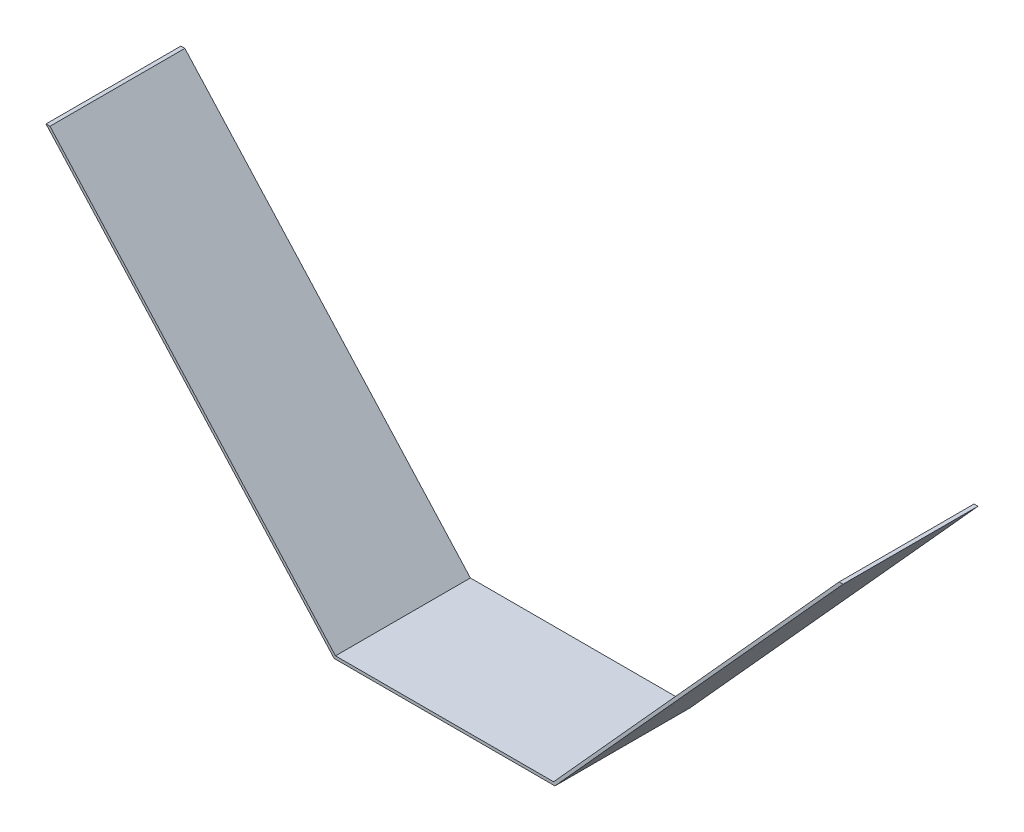
ISO-10303-21;
HEADER;
FILE_DESCRIPTION(('STEP AP214'),'2;1');
FILE_NAME('part.step','',(''),(''),'','','');
FILE_SCHEMA(('AUTOMOTIVE_DESIGN { 1 0 10303 214 1 1 1 1 }'));
ENDSEC;
DATA;
#1=APPLICATION_CONTEXT('core data for automotive mechanical design processes');
#2=APPLICATION_PROTOCOL_DEFINITION('international standard','automotive_design',2000,#1);
#3=PRODUCT_CONTEXT('',#1,'mechanical');
#4=PRODUCT('Part','Part','',(#3));
#5=PRODUCT_RELATED_PRODUCT_CATEGORY('part','',(#4));
#6=PRODUCT_DEFINITION_FORMATION('','',#4);
#7=PRODUCT_DEFINITION_CONTEXT('part definition',#1,'design');
#8=PRODUCT_DEFINITION('design','',#6,#7);
#9=PRODUCT_DEFINITION_SHAPE('','',#8);
#10=(LENGTH_UNIT() NAMED_UNIT(*) SI_UNIT(.MILLI.,.METRE.));
#11=(NAMED_UNIT(*) PLANE_ANGLE_UNIT() SI_UNIT($,.RADIAN.));
#12=(NAMED_UNIT(*) SI_UNIT($,.STERADIAN.) SOLID_ANGLE_UNIT());
#13=UNCERTAINTY_MEASURE_WITH_UNIT(LENGTH_MEASURE(1.E-05),#10,'distance_accuracy_value','');
#14=(GEOMETRIC_REPRESENTATION_CONTEXT(3) GLOBAL_UNCERTAINTY_ASSIGNED_CONTEXT((#13)) GLOBAL_UNIT_ASSIGNED_CONTEXT((#10,
#11,#12)) REPRESENTATION_CONTEXT('',''));
#15=CARTESIAN_POINT('',(0.,0.,0.));
#16=DIRECTION('',(0.,0.,1.));
#17=DIRECTION('',(1.,0.,0.));
#18=AXIS2_PLACEMENT_3D('',#15,#16,#17);
#19=CARTESIAN_POINT('',(-374.797674418605,95.5084302325581,69.85));
#20=DIRECTION('',(0.,1.,0.));
#21=DIRECTION('',(-1.,0.,0.));
#22=AXIS2_PLACEMENT_3D('',#19,#20,#21);
#23=PLANE('',#22);
#24=DIRECTION('',(1.,0.,0.));
#25=VECTOR('',#24,1.);
#26=CARTESIAN_POINT('',(-374.797674418605,95.5084302325581,69.85));
#27=LINE('',#26,#25);
#28=CARTESIAN_POINT('',(-374.797674418605,95.5084302325581,69.85));
#29=VERTEX_POINT('',#28);
#30=CARTESIAN_POINT('',(-372.743416331134,95.5084302325581,69.85));
#31=VERTEX_POINT('',#30);
#32=EDGE_CURVE('E123',#29,#31,#27,.T.);
#33=ORIENTED_EDGE('',*,*,#32,.T.);
#34=DIRECTION('',(0.,0.,-1.));
#35=VECTOR('',#34,1.);
#36=CARTESIAN_POINT('',(-372.743416331134,95.5084302325581,69.85));
#37=LINE('',#36,#35);
#38=CARTESIAN_POINT('',(-372.743416331134,95.5084302325581,0.));
#39=VERTEX_POINT('',#38);
#40=EDGE_CURVE('E112',#31,#39,#37,.T.);
#41=ORIENTED_EDGE('',*,*,#40,.T.);
#42=DIRECTION('',(1.,0.,0.));
#43=VECTOR('',#42,1.);
#44=CARTESIAN_POINT('',(-374.797674418605,95.5084302325581,0.));
#45=LINE('',#44,#43);
#46=CARTESIAN_POINT('',(-374.797674418605,95.5084302325581,0.));
#47=VERTEX_POINT('',#46);
#48=EDGE_CURVE('E121',#47,#39,#45,.T.);
#49=ORIENTED_EDGE('',*,*,#48,.F.);
#50=DIRECTION('',(0.,0.,-1.));
#51=VECTOR('',#50,1.);
#52=CARTESIAN_POINT('',(-374.797674418605,95.5084302325581,69.85));
#53=LINE('',#52,#51);
#54=EDGE_CURVE('E59',#29,#47,#53,.T.);
#55=ORIENTED_EDGE('',*,*,#54,.F.);
#56=EDGE_LOOP('',(#33,#41,#49,#55));
#57=FACE_BOUND('',#56,.T.);
#58=ADVANCED_FACE('F35',(#57),#23,.T.);
#59=CARTESIAN_POINT('',(-374.797674418605,95.5084302325581,69.85));
#60=DIRECTION('',(0.741873676581724,0.670539669218097,0.));
#61=DIRECTION('',(-0.670539669218097,0.741873676581724,0.));
#62=AXIS2_PLACEMENT_3D('',#59,#60,#61);
#63=PLANE('',#62);
#64=DIRECTION('',(0.670539669218097,-0.741873676581724,0.));
#65=VECTOR('',#64,1.);
#66=CARTESIAN_POINT('',(-374.797674418605,95.5084302325581,0.));
#67=LINE('',#66,#65);
#68=CARTESIAN_POINT('',(-225.572674418605,-69.5915697674419,0.));
#69=VERTEX_POINT('',#68);
#70=EDGE_CURVE('E128',#47,#69,#67,.T.);
#71=ORIENTED_EDGE('',*,*,#70,.T.);
#72=DIRECTION('',(0.,0.,-1.));
#73=VECTOR('',#72,1.);
#74=CARTESIAN_POINT('',(-225.572674418605,-69.5915697674419,69.85));
#75=LINE('',#74,#73);
#76=CARTESIAN_POINT('',(-225.572674418605,-69.5915697674419,69.85));
#77=VERTEX_POINT('',#76);
#78=EDGE_CURVE('E11',#77,#69,#75,.T.);
#79=ORIENTED_EDGE('',*,*,#78,.F.);
#80=DIRECTION('',(0.670539669218097,-0.741873676581724,0.));
#81=VECTOR('',#80,1.);
#82=CARTESIAN_POINT('',(-374.797674418605,95.5084302325581,69.85));
#83=LINE('',#82,#81);
#84=EDGE_CURVE('E129',#29,#77,#83,.T.);
#85=ORIENTED_EDGE('',*,*,#84,.F.);
#86=ORIENTED_EDGE('',*,*,#54,.T.);
#87=EDGE_LOOP('',(#71,#79,#85,#86));
#88=FACE_BOUND('',#87,.T.);
#89=ADVANCED_FACE('F37',(#88),#63,.F.);
#90=CARTESIAN_POINT('',(-225.572674418605,-69.5915697674419,69.85));
#91=DIRECTION('',(0.,1.,0.));
#92=DIRECTION('',(0.,0.,1.));
#93=AXIS2_PLACEMENT_3D('',#90,#91,#92);
#94=PLANE('',#93);
#95=DIRECTION('',(1.,0.,0.));
#96=VECTOR('',#95,1.);
#97=CARTESIAN_POINT('',(-225.572674418605,-69.5915697674419,0.));
#98=LINE('',#97,#96);
#99=CARTESIAN_POINT('',(-111.272674418605,-69.5915697674419,0.));
#100=VERTEX_POINT('',#99);
#101=EDGE_CURVE('E149',#69,#100,#98,.T.);
#102=ORIENTED_EDGE('',*,*,#101,.T.);
#103=DIRECTION('',(0.,0.,-1.));
#104=VECTOR('',#103,1.);
#105=CARTESIAN_POINT('',(-111.272674418605,-69.5915697674419,69.85));
#106=LINE('',#105,#104);
#107=CARTESIAN_POINT('',(-111.272674418605,-69.5915697674419,69.85));
#108=VERTEX_POINT('',#107);
#109=EDGE_CURVE('E43',#108,#100,#106,.T.);
#110=ORIENTED_EDGE('',*,*,#109,.F.);
#111=DIRECTION('',(1.,0.,0.));
#112=VECTOR('',#111,1.);
#113=CARTESIAN_POINT('',(-225.572674418605,-69.5915697674419,69.85));
#114=LINE('',#113,#112);
#115=EDGE_CURVE('E85',#77,#108,#114,.T.);
#116=ORIENTED_EDGE('',*,*,#115,.F.);
#117=ORIENTED_EDGE('',*,*,#78,.T.);
#118=EDGE_LOOP('',(#102,#110,#116,#117));
#119=FACE_BOUND('',#118,.T.);
#120=ADVANCED_FACE('F178',(#119),#94,.F.);
#121=CARTESIAN_POINT('',(-111.272674418605,-69.5915697674419,69.85));
#122=DIRECTION('',(-0.741873676581725,0.670539669218097,0.));
#123=DIRECTION('',(-0.670539669218097,-0.741873676581725,0.));
#124=AXIS2_PLACEMENT_3D('',#121,#122,#123);
#125=PLANE('',#124);
#126=DIRECTION('',(0.670539669218097,0.741873676581725,0.));
#127=VECTOR('',#126,1.);
#128=CARTESIAN_POINT('',(-111.272674418605,-69.5915697674419,0.));
#129=LINE('',#128,#127);
#130=CARTESIAN_POINT('',(37.9523255813953,95.5084302325582,0.));
#131=VERTEX_POINT('',#130);
#132=EDGE_CURVE('E133',#100,#131,#129,.T.);
#133=ORIENTED_EDGE('',*,*,#132,.T.);
#134=DIRECTION('',(0.,0.,-1.));
#135=VECTOR('',#134,1.);
#136=CARTESIAN_POINT('',(37.9523255813953,95.5084302325582,69.85));
#137=LINE('',#136,#135);
#138=CARTESIAN_POINT('',(37.9523255813953,95.5084302325582,69.85));
#139=VERTEX_POINT('',#138);
#140=EDGE_CURVE('E138',#139,#131,#137,.T.);
#141=ORIENTED_EDGE('',*,*,#140,.F.);
#142=DIRECTION('',(0.670539669218097,0.741873676581725,0.));
#143=VECTOR('',#142,1.);
#144=CARTESIAN_POINT('',(-111.272674418605,-69.5915697674419,69.85));
#145=LINE('',#144,#143);
#146=EDGE_CURVE('E148',#108,#139,#145,.T.);
#147=ORIENTED_EDGE('',*,*,#146,.F.);
#148=ORIENTED_EDGE('',*,*,#109,.T.);
#149=EDGE_LOOP('',(#133,#141,#147,#148));
#150=FACE_BOUND('',#149,.T.);
#151=ADVANCED_FACE('F145',(#150),#125,.F.);
#152=DIRECTION('',(0.,0.,-1.));
#153=VECTOR('',#152,1.);
#154=CARTESIAN_POINT('',(35.898067493924,95.5084302325582,69.85));
#155=LINE('',#154,#153);
#156=CARTESIAN_POINT('',(35.8980674939241,95.5084302325582,69.85));
#157=VERTEX_POINT('',#156);
#158=CARTESIAN_POINT('',(35.8980674939241,95.5084302325582,0.));
#159=VERTEX_POINT('',#158);
#160=EDGE_CURVE('E124',#157,#159,#155,.T.);
#161=ORIENTED_EDGE('',*,*,#160,.F.);
#162=EDGE_CURVE('E154',#157,#139,#27,.T.);
#163=ORIENTED_EDGE('',*,*,#162,.T.);
#164=ORIENTED_EDGE('',*,*,#140,.T.);
#165=EDGE_CURVE('E130',#159,#131,#45,.T.);
#166=ORIENTED_EDGE('',*,*,#165,.F.);
#167=EDGE_LOOP('',(#161,#163,#164,#166));
#168=FACE_BOUND('',#167,.T.);
#169=ADVANCED_FACE('F173',(#168),#23,.T.);
#170=CARTESIAN_POINT('',(0.,0.,69.85));
#171=DIRECTION('',(0.,0.,1.));
#172=DIRECTION('',(1.,0.,0.));
#173=AXIS2_PLACEMENT_3D('',#170,#171,#172);
#174=PLANE('',#173);
#175=DIRECTION('',(0.670539669218097,-0.741873676581724,0.));
#176=VECTOR('',#175,1.);
#177=CARTESIAN_POINT('',(-373.667058935494,96.5303326884465,69.85));
#178=LINE('',#177,#176);
#179=CARTESIAN_POINT('',(-224.895877869595,-68.0675697674419,69.85));
#180=VERTEX_POINT('',#179);
#181=EDGE_CURVE('E159',#31,#180,#178,.T.);
#182=ORIENTED_EDGE('',*,*,#181,.F.);
#183=ORIENTED_EDGE('',*,*,#32,.F.);
#184=ORIENTED_EDGE('',*,*,#84,.T.);
#185=ORIENTED_EDGE('',*,*,#115,.T.);
#186=ORIENTED_EDGE('',*,*,#146,.T.);
#187=ORIENTED_EDGE('',*,*,#162,.F.);
#188=DIRECTION('',(0.670539669218097,0.741873676581725,0.));
#189=VECTOR('',#188,1.);
#190=CARTESIAN_POINT('',(-112.403289901715,-68.5696673115535,69.85));
#191=LINE('',#190,#189);
#192=CARTESIAN_POINT('',(-111.949470967614,-68.0675697674419,69.85));
#193=VERTEX_POINT('',#192);
#194=EDGE_CURVE('E125',#193,#157,#191,.T.);
#195=ORIENTED_EDGE('',*,*,#194,.F.);
#196=DIRECTION('',(1.,0.,0.));
#197=VECTOR('',#196,1.);
#198=CARTESIAN_POINT('',(-225.572674418605,-68.0675697674419,69.85));
#199=LINE('',#198,#197);
#200=EDGE_CURVE('E163',#180,#193,#199,.T.);
#201=ORIENTED_EDGE('',*,*,#200,.F.);
#202=EDGE_LOOP('',(#182,#183,#184,#185,#186,#187,#195,#201));
#203=FACE_BOUND('',#202,.T.);
#204=ADVANCED_FACE('F176',(#203),#174,.T.);
#205=CARTESIAN_POINT('',(0.,0.,0.));
#206=DIRECTION('',(0.,0.,1.));
#207=DIRECTION('',(1.,0.,0.));
#208=AXIS2_PLACEMENT_3D('',#205,#206,#207);
#209=PLANE('',#208);
#210=ORIENTED_EDGE('',*,*,#48,.T.);
#211=DIRECTION('',(0.670539669218097,-0.741873676581724,0.));
#212=VECTOR('',#211,1.);
#213=CARTESIAN_POINT('',(-373.667058935494,96.5303326884465,0.));
#214=LINE('',#213,#212);
#215=CARTESIAN_POINT('',(-224.895877869595,-68.0675697674419,0.));
#216=VERTEX_POINT('',#215);
#217=EDGE_CURVE('E109',#39,#216,#214,.T.);
#218=ORIENTED_EDGE('',*,*,#217,.T.);
#219=DIRECTION('',(1.,0.,0.));
#220=VECTOR('',#219,1.);
#221=CARTESIAN_POINT('',(-225.572674418605,-68.0675697674419,0.));
#222=LINE('',#221,#220);
#223=CARTESIAN_POINT('',(-111.949470967614,-68.0675697674419,0.));
#224=VERTEX_POINT('',#223);
#225=EDGE_CURVE('E119',#216,#224,#222,.T.);
#226=ORIENTED_EDGE('',*,*,#225,.T.);
#227=DIRECTION('',(0.670539669218097,0.741873676581725,0.));
#228=VECTOR('',#227,1.);
#229=CARTESIAN_POINT('',(-112.403289901715,-68.5696673115535,0.));
#230=LINE('',#229,#228);
#231=EDGE_CURVE('E50',#224,#159,#230,.T.);
#232=ORIENTED_EDGE('',*,*,#231,.T.);
#233=ORIENTED_EDGE('',*,*,#165,.T.);
#234=ORIENTED_EDGE('',*,*,#132,.F.);
#235=ORIENTED_EDGE('',*,*,#101,.F.);
#236=ORIENTED_EDGE('',*,*,#70,.F.);
#237=EDGE_LOOP('',(#210,#218,#226,#232,#233,#234,#235,#236));
#238=FACE_BOUND('',#237,.T.);
#239=ADVANCED_FACE('F127',(#238),#209,.F.);
#240=CARTESIAN_POINT('',(-373.667058935494,96.5303326884465,69.85));
#241=DIRECTION('',(0.741873676581724,0.670539669218097,0.));
#242=DIRECTION('',(-0.670539669218097,0.741873676581724,0.));
#243=AXIS2_PLACEMENT_3D('',#240,#241,#242);
#244=PLANE('',#243);
#245=ORIENTED_EDGE('',*,*,#217,.F.);
#246=ORIENTED_EDGE('',*,*,#40,.F.);
#247=ORIENTED_EDGE('',*,*,#181,.T.);
#248=DIRECTION('',(0.,0.,-1.));
#249=VECTOR('',#248,1.);
#250=CARTESIAN_POINT('',(-224.895877869595,-68.0675697674419,69.85));
#251=LINE('',#250,#249);
#252=EDGE_CURVE('E115',#180,#216,#251,.T.);
#253=ORIENTED_EDGE('',*,*,#252,.T.);
#254=EDGE_LOOP('',(#245,#246,#247,#253));
#255=FACE_BOUND('',#254,.T.);
#256=ADVANCED_FACE('F111',(#255),#244,.T.);
#257=CARTESIAN_POINT('',(-225.572674418605,-68.0675697674419,69.85));
#258=DIRECTION('',(0.,1.,0.));
#259=DIRECTION('',(0.,0.,1.));
#260=AXIS2_PLACEMENT_3D('',#257,#258,#259);
#261=PLANE('',#260);
#262=ORIENTED_EDGE('',*,*,#225,.F.);
#263=ORIENTED_EDGE('',*,*,#252,.F.);
#264=ORIENTED_EDGE('',*,*,#200,.T.);
#265=DIRECTION('',(0.,0.,-1.));
#266=VECTOR('',#265,1.);
#267=CARTESIAN_POINT('',(-111.949470967614,-68.0675697674419,69.85));
#268=LINE('',#267,#266);
#269=EDGE_CURVE('E161',#193,#224,#268,.T.);
#270=ORIENTED_EDGE('',*,*,#269,.T.);
#271=EDGE_LOOP('',(#262,#263,#264,#270));
#272=FACE_BOUND('',#271,.T.);
#273=ADVANCED_FACE('F168',(#272),#261,.T.);
#274=CARTESIAN_POINT('',(-112.403289901715,-68.5696673115535,69.85));
#275=DIRECTION('',(-0.741873676581725,0.670539669218097,0.));
#276=DIRECTION('',(-0.670539669218097,-0.741873676581725,0.));
#277=AXIS2_PLACEMENT_3D('',#274,#275,#276);
#278=PLANE('',#277);
#279=ORIENTED_EDGE('',*,*,#231,.F.);
#280=ORIENTED_EDGE('',*,*,#269,.F.);
#281=ORIENTED_EDGE('',*,*,#194,.T.);
#282=ORIENTED_EDGE('',*,*,#160,.T.);
#283=EDGE_LOOP('',(#279,#280,#281,#282));
#284=FACE_BOUND('',#283,.T.);
#285=ADVANCED_FACE('F199',(#284),#278,.T.);
#286=CLOSED_SHELL('',(#58,#89,#120,#151,#169,#204,#239,#256,#273,#285));
#287=MANIFOLD_SOLID_BREP('B2',#286);
#288=ADVANCED_BREP_SHAPE_REPRESENTATION('',(#18,#287),#14);
#289=SHAPE_DEFINITION_REPRESENTATION(#9,#288);
ENDSEC;
END-ISO-10303-21;
